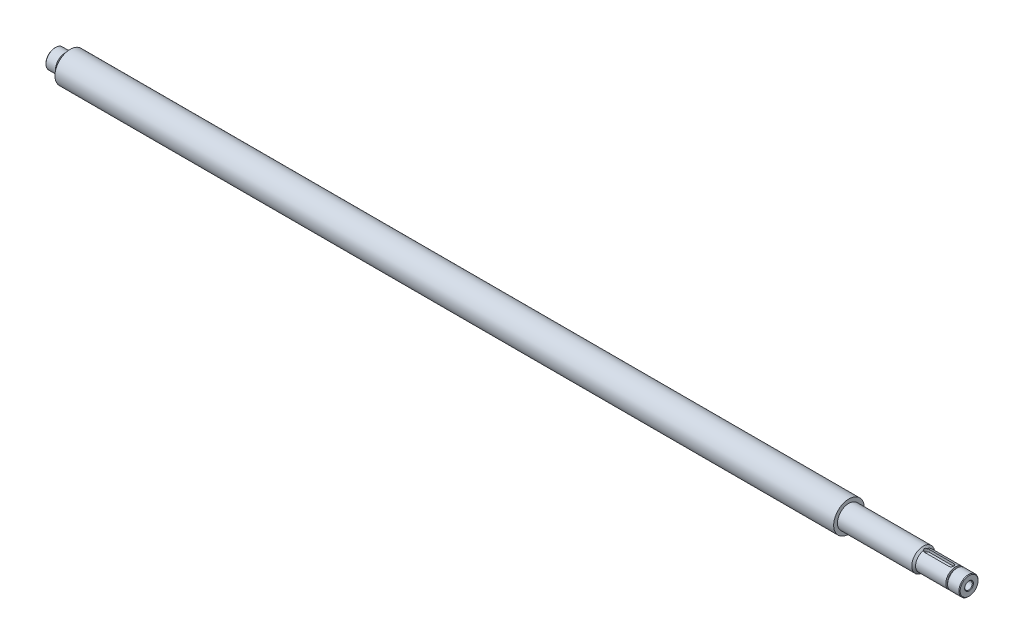
ISO-10303-21;
HEADER;
FILE_DESCRIPTION(('STEP AP214'),'2;1');
FILE_NAME('part.step','',(''),(''),'','','');
FILE_SCHEMA(('AUTOMOTIVE_DESIGN { 1 0 10303 214 1 1 1 1 }'));
ENDSEC;
DATA;
#1=APPLICATION_CONTEXT('core data for automotive mechanical design processes');
#2=APPLICATION_PROTOCOL_DEFINITION('international standard','automotive_design',2000,#1);
#3=PRODUCT_CONTEXT('',#1,'mechanical');
#4=PRODUCT('Part','Part','',(#3));
#5=PRODUCT_RELATED_PRODUCT_CATEGORY('part','',(#4));
#6=PRODUCT_DEFINITION_FORMATION('','',#4);
#7=PRODUCT_DEFINITION_CONTEXT('part definition',#1,'design');
#8=PRODUCT_DEFINITION('design','',#6,#7);
#9=PRODUCT_DEFINITION_SHAPE('','',#8);
#10=(LENGTH_UNIT() NAMED_UNIT(*) SI_UNIT(.MILLI.,.METRE.));
#11=(NAMED_UNIT(*) PLANE_ANGLE_UNIT() SI_UNIT($,.RADIAN.));
#12=(NAMED_UNIT(*) SI_UNIT($,.STERADIAN.) SOLID_ANGLE_UNIT());
#13=UNCERTAINTY_MEASURE_WITH_UNIT(LENGTH_MEASURE(1.E-05),#10,'distance_accuracy_value','');
#14=(GEOMETRIC_REPRESENTATION_CONTEXT(3) GLOBAL_UNCERTAINTY_ASSIGNED_CONTEXT((#13)) GLOBAL_UNIT_ASSIGNED_CONTEXT((#10,
#11,#12)) REPRESENTATION_CONTEXT('',''));
#15=CARTESIAN_POINT('',(0.,0.,0.));
#16=DIRECTION('',(0.,0.,1.));
#17=DIRECTION('',(1.,0.,0.));
#18=AXIS2_PLACEMENT_3D('',#15,#16,#17);
#19=CARTESIAN_POINT('',(364.29314999998,0.,0.));
#20=DIRECTION('',(1.,0.,0.));
#21=DIRECTION('',(0.,0.,-1.));
#22=AXIS2_PLACEMENT_3D('',#19,#20,#21);
#23=PLANE('',#22);
#24=CARTESIAN_POINT('',(364.29314999998,0.,0.));
#25=DIRECTION('',(1.,0.,0.));
#26=DIRECTION('',(0.,0.,-1.));
#27=AXIS2_PLACEMENT_3D('',#24,#25,#26);
#28=CIRCLE('',#27,1.5875);
#29=CARTESIAN_POINT('',(364.29314999998,0.,-1.5875));
#30=VERTEX_POINT('',#29);
#31=EDGE_CURVE('E19',#30,#30,#28,.T.);
#32=ORIENTED_EDGE('',*,*,#31,.T.);
#33=EDGE_LOOP('',(#32));
#34=FACE_BOUND('',#33,.T.);
#35=ADVANCED_FACE('F16',(#34),#23,.T.);
#36=CARTESIAN_POINT('',(364.29314999998,0.,0.));
#37=DIRECTION('',(1.,0.,0.));
#38=DIRECTION('',(0.,0.,-1.));
#39=AXIS2_PLACEMENT_3D('',#36,#37,#38);
#40=CYLINDRICAL_SURFACE('',#39,1.5875);
#41=ORIENTED_EDGE('',*,*,#31,.F.);
#42=EDGE_LOOP('',(#41));
#43=FACE_BOUND('',#42,.T.);
#44=CARTESIAN_POINT('',(383.089149999989,0.,0.));
#45=DIRECTION('',(1.,0.,0.));
#46=DIRECTION('',(0.,0.,-1.));
#47=AXIS2_PLACEMENT_3D('',#44,#45,#46);
#48=CIRCLE('',#47,1.58750000002783);
#49=CARTESIAN_POINT('',(383.089149999989,0.,-1.58750000002783));
#50=VERTEX_POINT('',#49);
#51=EDGE_CURVE('E108',#50,#50,#48,.T.);
#52=ORIENTED_EDGE('',*,*,#51,.T.);
#53=EDGE_LOOP('',(#52));
#54=FACE_BOUND('',#53,.T.);
#55=ADVANCED_FACE('F200',(#43,#54),#40,.F.);
#56=CARTESIAN_POINT('',(383.343149999916,0.,0.));
#57=DIRECTION('',(1.,0.,0.));
#58=DIRECTION('',(0.,1.,0.));
#59=AXIS2_PLACEMENT_3D('',#56,#57,#58);
#60=CONICAL_SURFACE('',#59,1.84149999989813,0.785398163397448);
#61=ORIENTED_EDGE('',*,*,#51,.F.);
#62=EDGE_LOOP('',(#61));
#63=FACE_BOUND('',#62,.T.);
#64=CARTESIAN_POINT('',(383.343149999973,0.,0.));
#65=DIRECTION('',(1.,0.,0.));
#66=DIRECTION('',(0.,1.,0.));
#67=AXIS2_PLACEMENT_3D('',#64,#65,#66);
#68=CIRCLE('',#67,1.84149999995498);
#69=CARTESIAN_POINT('',(383.343149999973,1.84149999995498,0.));
#70=VERTEX_POINT('',#69);
#71=EDGE_CURVE('E110',#70,#70,#68,.F.);
#72=ORIENTED_EDGE('',*,*,#71,.F.);
#73=EDGE_LOOP('',(#72));
#74=FACE_BOUND('',#73,.T.);
#75=ADVANCED_FACE('F197',(#63,#74),#60,.F.);
#76=CARTESIAN_POINT('',(383.34314999998,0.,0.));
#77=DIRECTION('',(1.,0.,0.));
#78=DIRECTION('',(0.,0.,-1.));
#79=AXIS2_PLACEMENT_3D('',#76,#77,#78);
#80=PLANE('',#79);
#81=CARTESIAN_POINT('',(383.343149999973,0.,0.));
#82=DIRECTION('',(-1.,0.,0.));
#83=DIRECTION('',(0.,0.,1.));
#84=AXIS2_PLACEMENT_3D('',#81,#82,#83);
#85=CIRCLE('',#84,3.71474999991506);
#86=CARTESIAN_POINT('',(383.343149999973,0.,3.71474999991506));
#87=VERTEX_POINT('',#86);
#88=EDGE_CURVE('E107',#87,#87,#85,.T.);
#89=ORIENTED_EDGE('',*,*,#88,.F.);
#90=EDGE_LOOP('',(#89));
#91=FACE_BOUND('',#90,.T.);
#92=ORIENTED_EDGE('',*,*,#71,.T.);
#93=EDGE_LOOP('',(#92));
#94=FACE_BOUND('',#93,.T.);
#95=ADVANCED_FACE('F193',(#91,#94),#80,.T.);
#96=CARTESIAN_POINT('',(383.089149999989,0.,0.));
#97=DIRECTION('',(-1.,0.,0.));
#98=DIRECTION('',(0.,0.,1.));
#99=AXIS2_PLACEMENT_3D('',#96,#97,#98);
#100=CONICAL_SURFACE('',#99,3.96874999989905,0.785398163397448);
#101=ORIENTED_EDGE('',*,*,#88,.T.);
#102=EDGE_LOOP('',(#101));
#103=FACE_BOUND('',#102,.T.);
#104=CARTESIAN_POINT('',(383.08914999998,0.,0.));
#105=DIRECTION('',(-1.,0.,0.));
#106=DIRECTION('',(0.,0.,1.));
#107=AXIS2_PLACEMENT_3D('',#104,#105,#106);
#108=CIRCLE('',#107,3.96875);
#109=CARTESIAN_POINT('',(383.08914999998,0.,3.96875));
#110=VERTEX_POINT('',#109);
#111=EDGE_CURVE('E103',#110,#110,#108,.T.);
#112=ORIENTED_EDGE('',*,*,#111,.F.);
#113=EDGE_LOOP('',(#112));
#114=FACE_BOUND('',#113,.T.);
#115=ADVANCED_FACE('F189',(#103,#114),#100,.T.);
#116=CARTESIAN_POINT('',(3.175,0.,0.));
#117=DIRECTION('',(-1.,0.,0.));
#118=DIRECTION('',(0.,0.,1.));
#119=AXIS2_PLACEMENT_3D('',#116,#117,#118);
#120=PLANE('',#119);
#121=CARTESIAN_POINT('',(3.17500000005566,0.,0.));
#122=DIRECTION('',(1.,0.,0.));
#123=DIRECTION('',(0.,0.,-1.));
#124=AXIS2_PLACEMENT_3D('',#121,#122,#123);
#125=CIRCLE('',#124,3.7147499999719);
#126=CARTESIAN_POINT('',(3.17500000005566,0.,-3.7147499999719));
#127=VERTEX_POINT('',#126);
#128=EDGE_CURVE('E106',#127,#127,#125,.T.);
#129=ORIENTED_EDGE('',*,*,#128,.F.);
#130=EDGE_LOOP('',(#129));
#131=FACE_BOUND('',#130,.T.);
#132=ADVANCED_FACE('F185',(#131),#120,.T.);
#133=CARTESIAN_POINT('',(383.34314999998,0.,0.));
#134=DIRECTION('',(-1.,0.,0.));
#135=DIRECTION('',(0.,0.,1.));
#136=AXIS2_PLACEMENT_3D('',#133,#134,#135);
#137=CYLINDRICAL_SURFACE('',#136,3.96875);
#138=ORIENTED_EDGE('',*,*,#111,.T.);
#139=EDGE_LOOP('',(#138));
#140=FACE_BOUND('',#139,.T.);
#141=CARTESIAN_POINT('',(378.36474999998,0.,0.));
#142=DIRECTION('',(-1.,0.,0.));
#143=DIRECTION('',(0.,0.,1.));
#144=AXIS2_PLACEMENT_3D('',#141,#142,#143);
#145=CIRCLE('',#144,3.96875);
#146=CARTESIAN_POINT('',(378.36474999998,0.,3.96875));
#147=VERTEX_POINT('',#146);
#148=EDGE_CURVE('E77',#147,#147,#145,.T.);
#149=ORIENTED_EDGE('',*,*,#148,.F.);
#150=EDGE_LOOP('',(#149));
#151=FACE_BOUND('',#150,.T.);
#152=ADVANCED_FACE('F181',(#140,#151),#137,.T.);
#153=CARTESIAN_POINT('',(3.42899999992596,0.,0.));
#154=DIRECTION('',(1.,0.,0.));
#155=DIRECTION('',(0.,0.,-1.));
#156=AXIS2_PLACEMENT_3D('',#153,#154,#155);
#157=CONICAL_SURFACE('',#156,3.96874999989905,0.785398163509345);
#158=ORIENTED_EDGE('',*,*,#128,.T.);
#159=EDGE_LOOP('',(#158));
#160=FACE_BOUND('',#159,.T.);
#161=CARTESIAN_POINT('',(3.42900000000003,0.,0.));
#162=DIRECTION('',(1.,0.,0.));
#163=DIRECTION('',(0.,0.,-1.));
#164=AXIS2_PLACEMENT_3D('',#161,#162,#163);
#165=CIRCLE('',#164,3.96875);
#166=CARTESIAN_POINT('',(3.42900000000003,0.,-3.96875));
#167=VERTEX_POINT('',#166);
#168=EDGE_CURVE('E99',#167,#167,#165,.T.);
#169=ORIENTED_EDGE('',*,*,#168,.F.);
#170=EDGE_LOOP('',(#169));
#171=FACE_BOUND('',#170,.T.);
#172=ADVANCED_FACE('F177',(#160,#171),#157,.T.);
#173=CARTESIAN_POINT('',(378.36474999998,0.,-22.225));
#174=DIRECTION('',(-1.,0.,0.));
#175=DIRECTION('',(0.,0.,1.));
#176=AXIS2_PLACEMENT_3D('',#173,#174,#175);
#177=PLANE('',#176);
#178=ORIENTED_EDGE('',*,*,#148,.T.);
#179=EDGE_LOOP('',(#178));
#180=FACE_BOUND('',#179,.T.);
#181=CARTESIAN_POINT('',(378.36474999998,0.,0.));
#182=DIRECTION('',(1.,0.,0.));
#183=DIRECTION('',(0.,0.,-1.));
#184=AXIS2_PLACEMENT_3D('',#181,#182,#183);
#185=CIRCLE('',#184,3.175);
#186=CARTESIAN_POINT('',(378.36474999998,0.,-3.175));
#187=VERTEX_POINT('',#186);
#188=EDGE_CURVE('E102',#187,#187,#185,.F.);
#189=ORIENTED_EDGE('',*,*,#188,.F.);
#190=EDGE_LOOP('',(#189));
#191=FACE_BOUND('',#190,.T.);
#192=ADVANCED_FACE('F171',(#180,#191),#177,.T.);
#193=CARTESIAN_POINT('',(365.81714999998,5.30554999999999,0.));
#194=DIRECTION('',(0.,-1.,0.));
#195=DIRECTION('',(0.,0.,-1.));
#196=AXIS2_PLACEMENT_3D('',#193,#194,#195);
#197=CYLINDRICAL_SURFACE('',#196,1.016);
#198=CARTESIAN_POINT('',(365.81714999998,3.83649847680146,1.01600000000003));
#199=CARTESIAN_POINT('',(365.789074339526,3.83649655807795,1.01600024098621));
#200=CARTESIAN_POINT('',(365.7610128192,3.83680706636788,1.01483546195629));
#201=CARTESIAN_POINT('',(365.705099410303,3.83803295663375,1.01019216098555));
#202=CARTESIAN_POINT('',(365.677247490381,3.83894824625515,1.00671399231573));
#203=CARTESIAN_POINT('',(365.594402662799,3.84256546981599,0.992856299490583));
#204=CARTESIAN_POINT('',(365.539979413233,3.84613895420594,0.979053401170294));
#205=CARTESIAN_POINT('',(365.434316289364,3.85519131533632,0.942773419508419));
#206=CARTESIAN_POINT('',(365.383076692287,3.86067035773495,0.920295581999039));
#207=CARTESIAN_POINT('',(365.285096296162,3.87291119616642,0.867334861884763));
#208=CARTESIAN_POINT('',(365.238352927547,3.87967225289173,0.836856589068619));
#209=CARTESIAN_POINT('',(365.169226267174,3.89074557233872,0.783245948925418));
#210=CARTESIAN_POINT('',(365.14492969341,3.89487805845011,0.76249275990274));
#211=CARTESIAN_POINT('',(365.09843710947,3.9031715311668,0.718833958468433));
#212=CARTESIAN_POINT('',(365.076237660529,3.9073324586808,0.695931996926632));
#213=CARTESIAN_POINT('',(365.055149999974,3.91144021589343,0.672020833004098));
#214=B_SPLINE_CURVE_WITH_KNOTS('',3,(#198,#199,#200,#201,#202,#203,#204,#205,#206,#207,#208,
#209,#210,#211,#212,#213),.UNSPECIFIED.,.F.,.F.,(4,2,2,2,2,2,2,4),(0.,0.084173300717206,
0.168333750525152,0.336236358766278,0.50415356714138,0.67197423449429,0.768506844657109,
0.864878312959558),.UNSPECIFIED.);
#215=CARTESIAN_POINT('',(365.81714999998,3.83649847680146,1.01600000000003));
#216=VERTEX_POINT('',#215);
#217=CARTESIAN_POINT('',(365.055149999982,3.91144021584078,0.672020833012472));
#218=VERTEX_POINT('',#217);
#219=EDGE_CURVE('E95',#216,#218,#214,.T.);
#220=ORIENTED_EDGE('',*,*,#219,.F.);
#221=DIRECTION('',(0.,-1.,0.));
#222=VECTOR('',#221,1.);
#223=CARTESIAN_POINT('',(365.81714999998,5.30554999999999,1.01600000000003));
#224=LINE('',#223,#222);
#225=CARTESIAN_POINT('',(365.81714999998,2.81634999999999,1.01600000000003));
#226=VERTEX_POINT('',#225);
#227=EDGE_CURVE('E93',#226,#216,#224,.F.);
#228=ORIENTED_EDGE('',*,*,#227,.F.);
#229=CARTESIAN_POINT('',(365.81714999998,2.81634999999999,0.));
#230=DIRECTION('',(0.,-1.,0.));
#231=DIRECTION('',(0.,0.,-1.));
#232=AXIS2_PLACEMENT_3D('',#229,#230,#231);
#233=CIRCLE('',#232,1.016);
#234=CARTESIAN_POINT('',(365.81714999998,2.81634999999999,-1.01599999999997));
#235=VERTEX_POINT('',#234);
#236=EDGE_CURVE('E91',#226,#235,#233,.T.);
#237=ORIENTED_EDGE('',*,*,#236,.T.);
#238=DIRECTION('',(0.,-1.,0.));
#239=VECTOR('',#238,1.);
#240=CARTESIAN_POINT('',(365.81714999998,5.30554999999999,-1.01599999999997));
#241=LINE('',#240,#239);
#242=CARTESIAN_POINT('',(365.81714999998,3.83649847680148,-1.01599999999997));
#243=VERTEX_POINT('',#242);
#244=EDGE_CURVE('E76',#243,#235,#241,.T.);
#245=ORIENTED_EDGE('',*,*,#244,.F.);
#246=CARTESIAN_POINT('',(365.05514999998,3.91144021589234,-0.672020833010454));
#247=CARTESIAN_POINT('',(365.092863201918,3.90408226838989,-0.714842817990914));
#248=CARTESIAN_POINT('',(365.134224918746,3.89655779756544,-0.754419427857203));
#249=CARTESIAN_POINT('',(365.223086497352,3.88197562196348,-0.826189348854452));
#250=CARTESIAN_POINT('',(365.270594355154,3.87491854366297,-0.858372887617566));
#251=CARTESIAN_POINT('',(365.37054734497,3.86208640953377,-0.914382203674269));
#252=CARTESIAN_POINT('',(365.422998681667,3.85631299621681,-0.938197295479835));
#253=CARTESIAN_POINT('',(365.531257868991,3.8467604993438,-0.976630360325471));
#254=CARTESIAN_POINT('',(365.587058548847,3.84297731334557,-0.991267264360344));
#255=CARTESIAN_POINT('',(365.672317957102,3.83912394272326,-1.00604532812612));
#256=CARTESIAN_POINT('',(365.701156173613,3.83814278398676,-1.0097754687014));
#257=CARTESIAN_POINT('',(365.75904132168,3.8368291335745,-1.01475220932442));
#258=CARTESIAN_POINT('',(365.78808810149,3.83649621045302,-1.01600046125276));
#259=CARTESIAN_POINT('',(365.81714999998,3.83649847680148,-1.01599999999997));
#260=B_SPLINE_CURVE_WITH_KNOTS('',3,(#246,#247,#248,#249,#250,#251,#252,#253,#254,#255,#256,
#257,#258,#259),.UNSPECIFIED.,.F.,.F.,(4,2,2,2,2,2,4),(0.,0.17240455398,0.345035702357616,
0.517886485481197,0.690379562391287,0.777564930764776,0.86469225137165),.UNSPECIFIED.);
#261=CARTESIAN_POINT('',(365.055149999968,3.91144021578482,-0.672020832996854));
#262=VERTEX_POINT('',#261);
#263=EDGE_CURVE('E66',#262,#243,#260,.T.);
#264=ORIENTED_EDGE('',*,*,#263,.F.);
#265=CARTESIAN_POINT('',(365.055149999937,3.91144021579326,0.672020832961947));
#266=CARTESIAN_POINT('',(365.026045649241,3.94663707757243,0.638985000088227));
#267=CARTESIAN_POINT('',(364.99813445496,3.98057362417654,0.603031915369367));
#268=CARTESIAN_POINT('',(364.945782346284,4.04446808087447,0.52463353926634));
#269=CARTESIAN_POINT('',(364.921387328837,4.07437308912116,0.482115200203082));
#270=CARTESIAN_POINT('',(364.88324642174,4.12126181441779,0.401911695213403));
#271=CARTESIAN_POINT('',(364.868355806798,4.13961619956198,0.365594566361844));
#272=CARTESIAN_POINT('',(364.842514459879,4.17151821849332,0.289723753061901));
#273=CARTESIAN_POINT('',(364.831548734036,4.18508414235761,0.25018310998333));
#274=CARTESIAN_POINT('',(364.814258213123,4.20649305464903,0.168050687431386));
#275=CARTESIAN_POINT('',(364.807988168618,4.21426852199973,0.125429079943492));
#276=CARTESIAN_POINT('',(364.800977206253,4.22296361722546,0.0390204895654291));
#277=CARTESIAN_POINT('',(364.800234806667,4.22388508236565,-0.00476617786333961));
#278=CARTESIAN_POINT('',(364.804035806214,4.21917025653282,-0.0849404597698114));
#279=CARTESIAN_POINT('',(364.807784476603,4.21451992539556,-0.121431098087903));
#280=CARTESIAN_POINT('',(364.818977695527,4.20064865423194,-0.192918818065849));
#281=CARTESIAN_POINT('',(364.826421938455,4.19142809214245,-0.227916022965843));
#282=CARTESIAN_POINT('',(364.847034893171,4.16593408534218,-0.305201192198014));
#283=CARTESIAN_POINT('',(364.861220946354,4.14841101056433,-0.346801535770036));
#284=CARTESIAN_POINT('',(364.893725643349,4.10836577713652,-0.425891694219275));
#285=CARTESIAN_POINT('',(364.912060244422,4.08582432097091,-0.463364783610832));
#286=CARTESIAN_POINT('',(364.950316407108,4.03894291029061,-0.53128121744061));
#287=CARTESIAN_POINT('',(364.97001172542,4.01486952292547,-0.562042296543696));
#288=CARTESIAN_POINT('',(365.011284433417,3.96459674581604,-0.619737119716292));
#289=CARTESIAN_POINT('',(365.032841403113,3.9384205992902,-0.646705536926426));
#290=CARTESIAN_POINT('',(365.055149999947,3.9114402157815,-0.672020832972935));
#291=B_SPLINE_CURVE_WITH_KNOTS('',3,(#265,#266,#267,#268,#269,#270,#271,#272,#273,#274,#275,
#276,#277,#278,#279,#280,#281,#282,#283,#284,#285,#286,#287,#288,#289,#290),.UNSPECIFIED.,.F.,
.F.,(4,2,2,2,2,2,2,2,2,2,2,2,4),(0.,0.169491291431036,0.34102606970601,0.470534814534422,
0.59954339215234,0.730033713382287,0.860489054471362,0.970897544435752,1.08129690565363,
1.22247535003477,1.364206353615,1.49517443421655,1.62485417002255),.UNSPECIFIED.);
#292=EDGE_CURVE('E60',#218,#262,#291,.T.);
#293=ORIENTED_EDGE('',*,*,#292,.F.);
#294=EDGE_LOOP('',(#220,#228,#237,#245,#264,#293));
#295=FACE_BOUND('',#294,.T.);
#296=ADVANCED_FACE('F89',(#295),#197,.F.);
#297=CARTESIAN_POINT('',(3.175,0.,0.));
#298=DIRECTION('',(1.,0.,0.));
#299=DIRECTION('',(0.,0.,-1.));
#300=AXIS2_PLACEMENT_3D('',#297,#298,#299);
#301=CYLINDRICAL_SURFACE('',#300,3.96875);
#302=ORIENTED_EDGE('',*,*,#168,.T.);
#303=EDGE_LOOP('',(#302));
#304=FACE_BOUND('',#303,.T.);
#305=CARTESIAN_POINT('',(7.39140000000003,0.,0.));
#306=DIRECTION('',(1.,0.,0.));
#307=DIRECTION('',(0.,0.,-1.));
#308=AXIS2_PLACEMENT_3D('',#305,#306,#307);
#309=CIRCLE('',#308,3.96875);
#310=CARTESIAN_POINT('',(7.39140000000003,0.,-3.96875));
#311=VERTEX_POINT('',#310);
#312=EDGE_CURVE('E262',#311,#311,#309,.T.);
#313=ORIENTED_EDGE('',*,*,#312,.F.);
#314=EDGE_LOOP('',(#313));
#315=FACE_BOUND('',#314,.T.);
#316=ADVANCED_FACE('F170',(#304,#315),#301,.T.);
#317=CARTESIAN_POINT('',(364.2614,0.,0.));
#318=DIRECTION('',(1.,0.,0.));
#319=DIRECTION('',(0.,0.,-1.));
#320=AXIS2_PLACEMENT_3D('',#317,#318,#319);
#321=CYLINDRICAL_SURFACE('',#320,3.175);
#322=CARTESIAN_POINT('',(377.62814999998,0.,0.));
#323=DIRECTION('',(1.,0.,0.));
#324=DIRECTION('',(0.,0.,-1.));
#325=AXIS2_PLACEMENT_3D('',#322,#323,#324);
#326=CIRCLE('',#325,3.175);
#327=CARTESIAN_POINT('',(377.62814999998,0.,-3.175));
#328=VERTEX_POINT('',#327);
#329=EDGE_CURVE('E258',#328,#328,#326,.F.);
#330=ORIENTED_EDGE('',*,*,#329,.F.);
#331=EDGE_LOOP('',(#330));
#332=FACE_BOUND('',#331,.T.);
#333=ORIENTED_EDGE('',*,*,#188,.T.);
#334=EDGE_LOOP('',(#333));
#335=FACE_BOUND('',#334,.T.);
#336=ADVANCED_FACE('F272',(#332,#335),#321,.T.);
#337=CARTESIAN_POINT('',(365.81714999998,2.81634999999999,0.));
#338=DIRECTION('',(0.,-1.,0.));
#339=DIRECTION('',(0.,0.,-1.));
#340=AXIS2_PLACEMENT_3D('',#337,#338,#339);
#341=PLANE('',#340);
#342=DIRECTION('',(1.,0.,0.));
#343=VECTOR('',#342,1.);
#344=CARTESIAN_POINT('',(365.81714999998,2.81634999999999,1.01600000000003));
#345=LINE('',#344,#343);
#346=CARTESIAN_POINT('',(375.97714999998,2.81634999999999,1.01600000000003));
#347=VERTEX_POINT('',#346);
#348=EDGE_CURVE('E254',#226,#347,#345,.T.);
#349=ORIENTED_EDGE('',*,*,#348,.T.);
#350=CARTESIAN_POINT('',(375.97714999998,2.81634999999999,0.));
#351=DIRECTION('',(0.,-1.,0.));
#352=DIRECTION('',(0.,0.,-1.));
#353=AXIS2_PLACEMENT_3D('',#350,#351,#352);
#354=CIRCLE('',#353,1.016);
#355=CARTESIAN_POINT('',(375.97714999998,2.81634999999999,-1.01599999999997));
#356=VERTEX_POINT('',#355);
#357=EDGE_CURVE('E256',#347,#356,#354,.F.);
#358=ORIENTED_EDGE('',*,*,#357,.T.);
#359=DIRECTION('',(-1.,0.,0.));
#360=VECTOR('',#359,1.);
#361=CARTESIAN_POINT('',(365.81714999998,2.81634999999999,-1.01599999999997));
#362=LINE('',#361,#360);
#363=EDGE_CURVE('E257',#356,#235,#362,.T.);
#364=ORIENTED_EDGE('',*,*,#363,.T.);
#365=ORIENTED_EDGE('',*,*,#236,.F.);
#366=EDGE_LOOP('',(#349,#358,#364,#365));
#367=FACE_BOUND('',#366,.T.);
#368=ADVANCED_FACE('F275',(#367),#341,.F.);
#369=CARTESIAN_POINT('',(7.39140000000003,0.,-22.225));
#370=DIRECTION('',(1.,0.,0.));
#371=DIRECTION('',(0.,0.,-1.));
#372=AXIS2_PLACEMENT_3D('',#369,#370,#371);
#373=PLANE('',#372);
#374=ORIENTED_EDGE('',*,*,#312,.T.);
#375=EDGE_LOOP('',(#374));
#376=FACE_BOUND('',#375,.T.);
#377=CARTESIAN_POINT('',(7.39140000000005,0.,0.));
#378=DIRECTION('',(1.,0.,0.));
#379=DIRECTION('',(0.,0.,-1.));
#380=AXIS2_PLACEMENT_3D('',#377,#378,#379);
#381=CIRCLE('',#380,3.17500000000005);
#382=CARTESIAN_POINT('',(7.39140000000005,0.,-3.17500000000005));
#383=VERTEX_POINT('',#382);
#384=EDGE_CURVE('E253',#383,#383,#381,.T.);
#385=ORIENTED_EDGE('',*,*,#384,.F.);
#386=EDGE_LOOP('',(#385));
#387=FACE_BOUND('',#386,.T.);
#388=ADVANCED_FACE('F281',(#376,#387),#373,.T.);
#389=CARTESIAN_POINT('',(377.62814999998,0.,-22.225));
#390=DIRECTION('',(1.,0.,0.));
#391=DIRECTION('',(0.,0.,-1.));
#392=AXIS2_PLACEMENT_3D('',#389,#390,#391);
#393=PLANE('',#392);
#394=CARTESIAN_POINT('',(377.62814999998,0.,0.));
#395=DIRECTION('',(-1.,0.,0.));
#396=DIRECTION('',(0.,0.,1.));
#397=AXIS2_PLACEMENT_3D('',#394,#395,#396);
#398=CIRCLE('',#397,3.96875);
#399=CARTESIAN_POINT('',(377.62814999998,0.,3.96875));
#400=VERTEX_POINT('',#399);
#401=EDGE_CURVE('E86',#400,#400,#398,.T.);
#402=ORIENTED_EDGE('',*,*,#401,.F.);
#403=EDGE_LOOP('',(#402));
#404=FACE_BOUND('',#403,.T.);
#405=ORIENTED_EDGE('',*,*,#329,.T.);
#406=EDGE_LOOP('',(#405));
#407=FACE_BOUND('',#406,.T.);
#408=ADVANCED_FACE('F287',(#404,#407),#393,.T.);
#409=CARTESIAN_POINT('',(365.81714999998,5.30554999999999,-1.01599999999997));
#410=DIRECTION('',(0.,0.,-1.));
#411=DIRECTION('',(-1.,0.,0.));
#412=AXIS2_PLACEMENT_3D('',#409,#410,#411);
#413=PLANE('',#412);
#414=ORIENTED_EDGE('',*,*,#363,.F.);
#415=DIRECTION('',(0.,-1.,0.));
#416=VECTOR('',#415,1.);
#417=CARTESIAN_POINT('',(375.97714999998,5.30554999999999,-1.01599999999997));
#418=LINE('',#417,#416);
#419=CARTESIAN_POINT('',(375.97714999998,3.83649847680148,-1.01599999999997));
#420=VERTEX_POINT('',#419);
#421=EDGE_CURVE('E84',#356,#420,#418,.F.);
#422=ORIENTED_EDGE('',*,*,#421,.T.);
#423=DIRECTION('',(-1.,0.,0.));
#424=VECTOR('',#423,1.);
#425=CARTESIAN_POINT('',(383.34314999998,3.83649847680148,-1.01599999999998));
#426=LINE('',#425,#424);
#427=EDGE_CURVE('E72',#243,#420,#426,.F.);
#428=ORIENTED_EDGE('',*,*,#427,.F.);
#429=ORIENTED_EDGE('',*,*,#244,.T.);
#430=EDGE_LOOP('',(#414,#422,#428,#429));
#431=FACE_BOUND('',#430,.T.);
#432=ADVANCED_FACE('F81',(#431),#413,.F.);
#433=CARTESIAN_POINT('',(375.97714999998,5.30554999999999,0.));
#434=DIRECTION('',(0.,-1.,0.));
#435=DIRECTION('',(0.,0.,-1.));
#436=AXIS2_PLACEMENT_3D('',#433,#434,#435);
#437=CYLINDRICAL_SURFACE('',#436,1.016);
#438=ORIENTED_EDGE('',*,*,#357,.F.);
#439=DIRECTION('',(0.,1.,0.));
#440=VECTOR('',#439,1.);
#441=CARTESIAN_POINT('',(375.97714999998,5.30554999999999,1.01600000000003));
#442=LINE('',#441,#440);
#443=CARTESIAN_POINT('',(375.97714999998,3.83649847680146,1.01600000000003));
#444=VERTEX_POINT('',#443);
#445=EDGE_CURVE('E34',#347,#444,#442,.T.);
#446=ORIENTED_EDGE('',*,*,#445,.T.);
#447=CARTESIAN_POINT('',(375.97714999998,3.83649847680148,-1.01599999999997));
#448=CARTESIAN_POINT('',(376.005232117698,3.8364965307861,-1.01600036882975));
#449=CARTESIAN_POINT('',(376.03330029599,3.83680719885179,-1.0148349780035));
#450=CARTESIAN_POINT('',(376.089226268173,3.83803367436216,-1.01018942257077));
#451=CARTESIAN_POINT('',(376.117084097897,3.83894937627158,-1.00670966165613));
#452=CARTESIAN_POINT('',(376.199921518973,3.8425670200339,-0.992850358077406));
#453=CARTESIAN_POINT('',(376.254331119969,3.84613973249548,-0.979050564349116));
#454=CARTESIAN_POINT('',(376.359962146837,3.85518959202628,-0.942780043809727));
#455=CARTESIAN_POINT('',(376.411183960423,3.86066650696061,-0.920310373877343));
#456=CARTESIAN_POINT('',(376.509157970993,3.87290441870489,-0.867366047154576));
#457=CARTESIAN_POINT('',(376.555908865854,3.87966578790086,-0.836889067919602));
#458=CARTESIAN_POINT('',(376.644660726039,3.89388354188958,-0.76805250279463));
#459=CARTESIAN_POINT('',(376.686543604242,3.90135139962633,-0.729543072267722));
#460=CARTESIAN_POINT('',(376.763335608172,3.91604199140291,-0.646053823404773));
#461=CARTESIAN_POINT('',(376.798243613297,3.92326468589965,-0.601072967345447));
#462=CARTESIAN_POINT('',(376.860580248618,3.93677879775893,-0.50510200654503));
#463=CARTESIAN_POINT('',(376.88789163842,3.94305499816506,-0.454033423400695));
#464=CARTESIAN_POINT('',(376.933495722822,3.95383663506577,-0.347844862832095));
#465=CARTESIAN_POINT('',(376.951790252562,3.95834243184069,-0.292725712418508));
#466=CARTESIAN_POINT('',(376.978461233202,3.96499439613665,-0.181237611453934));
#467=CARTESIAN_POINT('',(376.987039572087,3.9671885264225,-0.124919869410297));
#468=CARTESIAN_POINT('',(376.994668963786,3.96913729991417,-0.0116034940671553));
#469=CARTESIAN_POINT('',(376.99372128116,3.96889226691424,0.0453950478541406));
#470=CARTESIAN_POINT('',(376.982469291487,3.96602573182547,0.157050518952893));
#471=CARTESIAN_POINT('',(376.972383179651,3.9634596510183,0.211731074693986));
#472=CARTESIAN_POINT('',(376.943492100012,3.95630422351476,0.318595637923097));
#473=CARTESIAN_POINT('',(376.9246867361,3.95171478489952,0.37077953187116));
#474=CARTESIAN_POINT('',(376.878717503722,3.94094438262645,0.471739184881145));
#475=CARTESIAN_POINT('',(376.851476902399,3.93474889714661,0.520478392673244));
#476=CARTESIAN_POINT('',(376.789469375868,3.92143706805957,0.612768417256418));
#477=CARTESIAN_POINT('',(376.754701251652,3.91432057782425,0.656318405775385));
#478=CARTESIAN_POINT('',(376.677464717508,3.89970329674694,0.738292158129691));
#479=CARTESIAN_POINT('',(376.634806538737,3.89219732876389,0.776536373111752));
#480=CARTESIAN_POINT('',(376.543591617661,3.87782831789178,0.845378453000194));
#481=CARTESIAN_POINT('',(376.495033261568,3.87096545181421,0.875974218910324));
#482=CARTESIAN_POINT('',(376.393023080127,3.8586388773889,0.928775964053226));
#483=CARTESIAN_POINT('',(376.339544393242,3.8531835536007,0.950932025157885));
#484=CARTESIAN_POINT('',(376.229478708631,3.84439831971569,0.985853852591684));
#485=CARTESIAN_POINT('',(376.17289650192,3.84106522846847,0.998633677961683));
#486=CARTESIAN_POINT('',(376.092708062573,3.83816902624918,1.00967440468688));
#487=CARTESIAN_POINT('',(376.069645740232,3.8375435800947,1.01204684611684));
#488=CARTESIAN_POINT('',(376.023442626753,3.83670846641588,1.01520789726257));
#489=CARTESIAN_POINT('',(376.000302021728,3.83649813111499,1.01599905077559));
#490=CARTESIAN_POINT('',(375.97714999998,3.83649847680146,1.01600000000003));
#491=B_SPLINE_CURVE_WITH_KNOTS('',3,(#447,#448,#449,#450,#451,#452,#453,#454,#455,#456,#457,
#458,#459,#460,#461,#462,#463,#464,#465,#466,#467,#468,#469,#470,#471,#472,#473,#474,#475,#476,
#477,#478,#479,#480,#481,#482,#483,#484,#485,#486,#487,#488,#489,#490),.UNSPECIFIED.,.F.,.F.,(4,
2,2,2,2,2,2,2,2,2,2,2,2,2,2,2,2,2,2,2,2,4),(0.,0.0841930560916811,0.16837143037474,
0.336236459648141,0.504081032233321,0.671974340399637,0.843336289917674,1.01472574881463,
1.18862960092247,1.36249804493094,1.53268338742047,1.7028461384339,1.8690500457987,
2.03526150439915,2.20303170807668,2.37082865446001,2.54336536457755,2.71594937282154,
2.88953887011914,3.06286754658296,3.13239841206051,3.20181733382417),.UNSPECIFIED.);
#492=EDGE_CURVE('E85',#420,#444,#491,.T.);
#493=ORIENTED_EDGE('',*,*,#492,.F.);
#494=ORIENTED_EDGE('',*,*,#421,.F.);
#495=EDGE_LOOP('',(#438,#446,#493,#494));
#496=FACE_BOUND('',#495,.T.);
#497=ADVANCED_FACE('F136',(#496),#437,.F.);
#498=CARTESIAN_POINT('',(365.81714999998,5.30554999999999,1.01600000000003));
#499=DIRECTION('',(0.,0.,1.));
#500=DIRECTION('',(1.,0.,0.));
#501=AXIS2_PLACEMENT_3D('',#498,#499,#500);
#502=PLANE('',#501);
#503=ORIENTED_EDGE('',*,*,#348,.F.);
#504=ORIENTED_EDGE('',*,*,#227,.T.);
#505=DIRECTION('',(-1.,0.,0.));
#506=VECTOR('',#505,1.);
#507=CARTESIAN_POINT('',(383.34314999998,3.83649847680146,1.01600000000002));
#508=LINE('',#507,#506);
#509=EDGE_CURVE('E127',#444,#216,#508,.T.);
#510=ORIENTED_EDGE('',*,*,#509,.F.);
#511=ORIENTED_EDGE('',*,*,#445,.F.);
#512=EDGE_LOOP('',(#503,#504,#510,#511));
#513=FACE_BOUND('',#512,.T.);
#514=ADVANCED_FACE('F295',(#513),#502,.F.);
#515=CARTESIAN_POINT('',(364.2614,0.,0.));
#516=DIRECTION('',(1.,0.,0.));
#517=DIRECTION('',(0.,0.,-1.));
#518=AXIS2_PLACEMENT_3D('',#515,#516,#517);
#519=CYLINDRICAL_SURFACE('',#518,3.17500000000005);
#520=ORIENTED_EDGE('',*,*,#384,.T.);
#521=EDGE_LOOP('',(#520));
#522=FACE_BOUND('',#521,.T.);
#523=CARTESIAN_POINT('',(8.12800000000002,0.,0.));
#524=DIRECTION('',(1.,0.,0.));
#525=DIRECTION('',(0.,0.,-1.));
#526=AXIS2_PLACEMENT_3D('',#523,#524,#525);
#527=CIRCLE('',#526,3.17500000000005);
#528=CARTESIAN_POINT('',(8.12800000000002,0.,-3.17500000000005));
#529=VERTEX_POINT('',#528);
#530=EDGE_CURVE('E124',#529,#529,#527,.T.);
#531=ORIENTED_EDGE('',*,*,#530,.F.);
#532=EDGE_LOOP('',(#531));
#533=FACE_BOUND('',#532,.T.);
#534=ADVANCED_FACE('F145',(#522,#533),#519,.T.);
#535=CARTESIAN_POINT('',(383.34314999998,0.,0.));
#536=DIRECTION('',(-1.,0.,0.));
#537=DIRECTION('',(0.,0.,1.));
#538=AXIS2_PLACEMENT_3D('',#535,#536,#537);
#539=CYLINDRICAL_SURFACE('',#538,3.96875);
#540=ORIENTED_EDGE('',*,*,#219,.T.);
#541=CARTESIAN_POINT('',(365.055149999989,0.,0.));
#542=DIRECTION('',(-1.,0.,0.));
#543=DIRECTION('',(0.,0.,-1.));
#544=AXIS2_PLACEMENT_3D('',#541,#542,#543);
#545=CIRCLE('',#544,3.96874999989905);
#546=EDGE_CURVE('E73',#262,#218,#545,.T.);
#547=ORIENTED_EDGE('',*,*,#546,.F.);
#548=ORIENTED_EDGE('',*,*,#263,.T.);
#549=ORIENTED_EDGE('',*,*,#427,.T.);
#550=ORIENTED_EDGE('',*,*,#492,.T.);
#551=ORIENTED_EDGE('',*,*,#509,.T.);
#552=EDGE_LOOP('',(#540,#547,#548,#549,#550,#551));
#553=FACE_BOUND('',#552,.T.);
#554=ORIENTED_EDGE('',*,*,#401,.T.);
#555=EDGE_LOOP('',(#554));
#556=FACE_BOUND('',#555,.T.);
#557=ADVANCED_FACE('F69',(#553,#556),#539,.T.);
#558=CARTESIAN_POINT('',(8.128,0.,-22.225));
#559=DIRECTION('',(-1.,0.,0.));
#560=DIRECTION('',(0.,0.,1.));
#561=AXIS2_PLACEMENT_3D('',#558,#559,#560);
#562=PLANE('',#561);
#563=CARTESIAN_POINT('',(8.128,0.,0.));
#564=DIRECTION('',(1.,0.,0.));
#565=DIRECTION('',(0.,0.,-1.));
#566=AXIS2_PLACEMENT_3D('',#563,#564,#565);
#567=CIRCLE('',#566,3.96875);
#568=CARTESIAN_POINT('',(8.128,0.,-3.96875));
#569=VERTEX_POINT('',#568);
#570=EDGE_CURVE('E121',#569,#569,#567,.T.);
#571=ORIENTED_EDGE('',*,*,#570,.F.);
#572=EDGE_LOOP('',(#571));
#573=FACE_BOUND('',#572,.T.);
#574=ORIENTED_EDGE('',*,*,#530,.T.);
#575=EDGE_LOOP('',(#574));
#576=FACE_BOUND('',#575,.T.);
#577=ADVANCED_FACE('F144',(#573,#576),#562,.T.);
#578=CARTESIAN_POINT('',(364.261400000032,0.,0.));
#579=DIRECTION('',(-1.,0.,0.));
#580=DIRECTION('',(0.,0.,1.));
#581=AXIS2_PLACEMENT_3D('',#578,#579,#580);
#582=CONICAL_SURFACE('',#581,4.76249999985612,0.785398163433255);
#583=ORIENTED_EDGE('',*,*,#546,.T.);
#584=ORIENTED_EDGE('',*,*,#292,.T.);
#585=EDGE_LOOP('',(#583,#584));
#586=FACE_BOUND('',#585,.T.);
#587=CARTESIAN_POINT('',(364.2614,0.,0.));
#588=DIRECTION('',(-1.,0.,0.));
#589=DIRECTION('',(0.,0.,1.));
#590=AXIS2_PLACEMENT_3D('',#587,#588,#589);
#591=CIRCLE('',#590,4.7625);
#592=CARTESIAN_POINT('',(364.2614,0.,4.7625));
#593=VERTEX_POINT('',#592);
#594=EDGE_CURVE('E120',#593,#593,#591,.T.);
#595=ORIENTED_EDGE('',*,*,#594,.F.);
#596=EDGE_LOOP('',(#595));
#597=FACE_BOUND('',#596,.T.);
#598=ADVANCED_FACE('F233',(#586,#597),#582,.T.);
#599=CARTESIAN_POINT('',(3.175,0.,0.));
#600=DIRECTION('',(1.,0.,0.));
#601=DIRECTION('',(0.,0.,-1.));
#602=AXIS2_PLACEMENT_3D('',#599,#600,#601);
#603=CYLINDRICAL_SURFACE('',#602,3.96875);
#604=CARTESIAN_POINT('',(9.525,0.,0.));
#605=DIRECTION('',(1.,0.,0.));
#606=DIRECTION('',(0.,0.,-1.));
#607=AXIS2_PLACEMENT_3D('',#604,#605,#606);
#608=CIRCLE('',#607,3.96875);
#609=CARTESIAN_POINT('',(9.525,0.,-3.96875));
#610=VERTEX_POINT('',#609);
#611=EDGE_CURVE('E117',#610,#610,#608,.T.);
#612=ORIENTED_EDGE('',*,*,#611,.F.);
#613=EDGE_LOOP('',(#612));
#614=FACE_BOUND('',#613,.T.);
#615=ORIENTED_EDGE('',*,*,#570,.T.);
#616=EDGE_LOOP('',(#615));
#617=FACE_BOUND('',#616,.T.);
#618=ADVANCED_FACE('F230',(#614,#617),#603,.T.);
#619=CARTESIAN_POINT('',(364.2614,0.,0.));
#620=DIRECTION('',(-1.,0.,0.));
#621=DIRECTION('',(0.,0.,1.));
#622=AXIS2_PLACEMENT_3D('',#619,#620,#621);
#623=CYLINDRICAL_SURFACE('',#622,4.7625);
#624=CARTESIAN_POINT('',(333.375,0.,0.));
#625=DIRECTION('',(-1.,0.,0.));
#626=DIRECTION('',(0.,0.,1.));
#627=AXIS2_PLACEMENT_3D('',#624,#625,#626);
#628=CIRCLE('',#627,4.7625);
#629=CARTESIAN_POINT('',(333.375,0.,4.7625));
#630=VERTEX_POINT('',#629);
#631=EDGE_CURVE('E114',#630,#630,#628,.T.);
#632=ORIENTED_EDGE('',*,*,#631,.F.);
#633=EDGE_LOOP('',(#632));
#634=FACE_BOUND('',#633,.T.);
#635=ORIENTED_EDGE('',*,*,#594,.T.);
#636=EDGE_LOOP('',(#635));
#637=FACE_BOUND('',#636,.T.);
#638=ADVANCED_FACE('F226',(#634,#637),#623,.T.);
#639=CARTESIAN_POINT('',(9.525,6.35000000000002,0.));
#640=DIRECTION('',(-1.,0.,0.));
#641=DIRECTION('',(0.,0.,1.));
#642=AXIS2_PLACEMENT_3D('',#639,#640,#641);
#643=PLANE('',#642);
#644=ORIENTED_EDGE('',*,*,#611,.T.);
#645=EDGE_LOOP('',(#644));
#646=FACE_BOUND('',#645,.T.);
#647=CARTESIAN_POINT('',(9.52500000000001,0.,0.));
#648=DIRECTION('',(1.,0.,0.));
#649=DIRECTION('',(0.,0.,-1.));
#650=AXIS2_PLACEMENT_3D('',#647,#648,#649);
#651=CIRCLE('',#650,6.35000000000002);
#652=CARTESIAN_POINT('',(9.52500000000001,0.,-6.35000000000002));
#653=VERTEX_POINT('',#652);
#654=EDGE_CURVE('E25',#653,#653,#651,.T.);
#655=ORIENTED_EDGE('',*,*,#654,.F.);
#656=EDGE_LOOP('',(#655));
#657=FACE_BOUND('',#656,.T.);
#658=ADVANCED_FACE('F219',(#646,#657),#643,.T.);
#659=CARTESIAN_POINT('',(333.375,0.,0.));
#660=DIRECTION('',(1.,0.,0.));
#661=DIRECTION('',(0.,0.,-1.));
#662=AXIS2_PLACEMENT_3D('',#659,#660,#661);
#663=PLANE('',#662);
#664=ORIENTED_EDGE('',*,*,#631,.T.);
#665=EDGE_LOOP('',(#664));
#666=FACE_BOUND('',#665,.T.);
#667=CARTESIAN_POINT('',(333.375,0.,0.));
#668=DIRECTION('',(1.,0.,0.));
#669=DIRECTION('',(0.,0.,-1.));
#670=AXIS2_PLACEMENT_3D('',#667,#668,#669);
#671=CIRCLE('',#670,6.35000000000002);
#672=CARTESIAN_POINT('',(333.375,0.,-6.35000000000002));
#673=VERTEX_POINT('',#672);
#674=EDGE_CURVE('E11',#673,#673,#671,.F.);
#675=ORIENTED_EDGE('',*,*,#674,.F.);
#676=EDGE_LOOP('',(#675));
#677=FACE_BOUND('',#676,.T.);
#678=ADVANCED_FACE('F213',(#666,#677),#663,.T.);
#679=CARTESIAN_POINT('',(9.525,0.,0.));
#680=DIRECTION('',(1.,0.,0.));
#681=DIRECTION('',(0.,0.,-1.));
#682=AXIS2_PLACEMENT_3D('',#679,#680,#681);
#683=CYLINDRICAL_SURFACE('',#682,6.35000000000002);
#684=ORIENTED_EDGE('',*,*,#654,.T.);
#685=EDGE_LOOP('',(#684));
#686=FACE_BOUND('',#685,.T.);
#687=ORIENTED_EDGE('',*,*,#674,.T.);
#688=EDGE_LOOP('',(#687));
#689=FACE_BOUND('',#688,.T.);
#690=ADVANCED_FACE('F211',(#686,#689),#683,.T.);
#691=CLOSED_SHELL('',(#35,#55,#75,#95,#115,#132,#152,#172,#192,#296,#316,#336,#368,#388,#408,
#432,#497,#514,#534,#557,#577,#598,#618,#638,#658,#678,#690));
#692=MANIFOLD_SOLID_BREP('B1',#691);
#693=ADVANCED_BREP_SHAPE_REPRESENTATION('',(#18,#692),#14);
#694=SHAPE_DEFINITION_REPRESENTATION(#9,#693);
ENDSEC;
END-ISO-10303-21;
